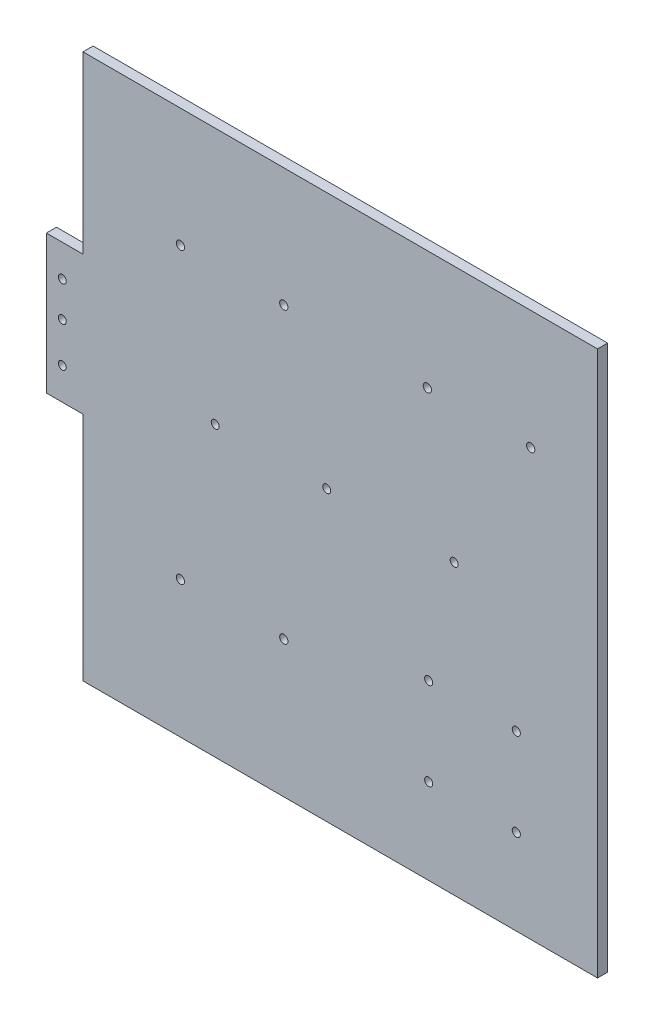
ISO-10303-21;
HEADER;
FILE_DESCRIPTION(('STEP AP214'),'2;1');
FILE_NAME('part.step','',(''),(''),'','','');
FILE_SCHEMA(('AUTOMOTIVE_DESIGN { 1 0 10303 214 1 1 1 1 }'));
ENDSEC;
DATA;
#1=APPLICATION_CONTEXT('core data for automotive mechanical design processes');
#2=APPLICATION_PROTOCOL_DEFINITION('international standard','automotive_design',2000,#1);
#3=PRODUCT_CONTEXT('',#1,'mechanical');
#4=PRODUCT('Part','Part','',(#3));
#5=PRODUCT_RELATED_PRODUCT_CATEGORY('part','',(#4));
#6=PRODUCT_DEFINITION_FORMATION('','',#4);
#7=PRODUCT_DEFINITION_CONTEXT('part definition',#1,'design');
#8=PRODUCT_DEFINITION('design','',#6,#7);
#9=PRODUCT_DEFINITION_SHAPE('','',#8);
#10=(LENGTH_UNIT() NAMED_UNIT(*) SI_UNIT(.MILLI.,.METRE.));
#11=(NAMED_UNIT(*) PLANE_ANGLE_UNIT() SI_UNIT($,.RADIAN.));
#12=(NAMED_UNIT(*) SI_UNIT($,.STERADIAN.) SOLID_ANGLE_UNIT());
#13=UNCERTAINTY_MEASURE_WITH_UNIT(LENGTH_MEASURE(1.E-05),#10,'distance_accuracy_value','');
#14=(GEOMETRIC_REPRESENTATION_CONTEXT(3) GLOBAL_UNCERTAINTY_ASSIGNED_CONTEXT((#13)) GLOBAL_UNIT_ASSIGNED_CONTEXT((#10,
#11,#12)) REPRESENTATION_CONTEXT('',''));
#15=CARTESIAN_POINT('',(0.,0.,0.));
#16=DIRECTION('',(0.,0.,1.));
#17=DIRECTION('',(1.,0.,0.));
#18=AXIS2_PLACEMENT_3D('',#15,#16,#17);
#19=CARTESIAN_POINT('',(691.84061693696,302.611489719056,-6.35));
#20=DIRECTION('',(1.,0.,0.));
#21=DIRECTION('',(0.,0.,-1.));
#22=AXIS2_PLACEMENT_3D('',#19,#20,#21);
#23=PLANE('',#22);
#24=DIRECTION('',(0.,1.,0.));
#25=VECTOR('',#24,1.);
#26=CARTESIAN_POINT('',(691.84061693696,302.611489719056,0.));
#27=LINE('',#26,#25);
#28=CARTESIAN_POINT('',(691.84061693696,302.611489719056,0.));
#29=VERTEX_POINT('',#28);
#30=CARTESIAN_POINT('',(691.84061693696,644.611489719056,0.));
#31=VERTEX_POINT('',#30);
#32=EDGE_CURVE('E134',#29,#31,#27,.T.);
#33=ORIENTED_EDGE('',*,*,#32,.F.);
#34=DIRECTION('',(0.,0.,1.));
#35=VECTOR('',#34,1.);
#36=CARTESIAN_POINT('',(691.84061693696,302.611489719056,-6.35));
#37=LINE('',#36,#35);
#38=CARTESIAN_POINT('',(691.84061693696,302.611489719056,-6.35));
#39=VERTEX_POINT('',#38);
#40=EDGE_CURVE('E11',#39,#29,#37,.T.);
#41=ORIENTED_EDGE('',*,*,#40,.F.);
#42=DIRECTION('',(0.,1.,0.));
#43=VECTOR('',#42,1.);
#44=CARTESIAN_POINT('',(691.84061693696,302.611489719056,-6.35));
#45=LINE('',#44,#43);
#46=CARTESIAN_POINT('',(691.84061693696,644.611489719056,-6.35));
#47=VERTEX_POINT('',#46);
#48=EDGE_CURVE('E155',#39,#47,#45,.T.);
#49=ORIENTED_EDGE('',*,*,#48,.T.);
#50=DIRECTION('',(0.,0.,1.));
#51=VECTOR('',#50,1.);
#52=CARTESIAN_POINT('',(691.84061693696,644.611489719056,-6.35));
#53=LINE('',#52,#51);
#54=EDGE_CURVE('E40',#47,#31,#53,.T.);
#55=ORIENTED_EDGE('',*,*,#54,.T.);
#56=EDGE_LOOP('',(#33,#41,#49,#55));
#57=FACE_BOUND('',#56,.T.);
#58=ADVANCED_FACE('F37',(#57),#23,.T.);
#59=CARTESIAN_POINT('',(691.84061693696,302.611489719056,-6.35));
#60=DIRECTION('',(0.,-1.,0.));
#61=DIRECTION('',(1.,0.,0.));
#62=AXIS2_PLACEMENT_3D('',#59,#60,#61);
#63=PLANE('',#62);
#64=DIRECTION('',(1.,0.,0.));
#65=VECTOR('',#64,1.);
#66=CARTESIAN_POINT('',(691.84061693696,302.611489719056,0.));
#67=LINE('',#66,#65);
#68=CARTESIAN_POINT('',(368.84061693696,302.611489719056,0.));
#69=VERTEX_POINT('',#68);
#70=EDGE_CURVE('E153',#69,#29,#67,.T.);
#71=ORIENTED_EDGE('',*,*,#70,.F.);
#72=DIRECTION('',(0.,0.,1.));
#73=VECTOR('',#72,1.);
#74=CARTESIAN_POINT('',(368.84061693696,302.611489719056,-6.35));
#75=LINE('',#74,#73);
#76=CARTESIAN_POINT('',(368.84061693696,302.611489719056,-6.35));
#77=VERTEX_POINT('',#76);
#78=EDGE_CURVE('E46',#77,#69,#75,.T.);
#79=ORIENTED_EDGE('',*,*,#78,.F.);
#80=DIRECTION('',(1.,0.,0.));
#81=VECTOR('',#80,1.);
#82=CARTESIAN_POINT('',(691.84061693696,302.611489719056,-6.35));
#83=LINE('',#82,#81);
#84=EDGE_CURVE('E124',#77,#39,#83,.T.);
#85=ORIENTED_EDGE('',*,*,#84,.T.);
#86=ORIENTED_EDGE('',*,*,#40,.T.);
#87=EDGE_LOOP('',(#71,#79,#85,#86));
#88=FACE_BOUND('',#87,.T.);
#89=ADVANCED_FACE('F167',(#88),#63,.T.);
#90=CARTESIAN_POINT('',(368.84061693696,447.611489719056,-6.35));
#91=DIRECTION('',(-1.,0.,0.));
#92=DIRECTION('',(0.,0.,1.));
#93=AXIS2_PLACEMENT_3D('',#90,#91,#92);
#94=PLANE('',#93);
#95=DIRECTION('',(0.,-1.,0.));
#96=VECTOR('',#95,1.);
#97=CARTESIAN_POINT('',(368.84061693696,447.611489719056,0.));
#98=LINE('',#97,#96);
#99=CARTESIAN_POINT('',(368.84061693696,447.611489719056,0.));
#100=VERTEX_POINT('',#99);
#101=EDGE_CURVE('E111',#100,#69,#98,.T.);
#102=ORIENTED_EDGE('',*,*,#101,.F.);
#103=DIRECTION('',(0.,0.,1.));
#104=VECTOR('',#103,1.);
#105=CARTESIAN_POINT('',(368.84061693696,447.611489719056,-6.35));
#106=LINE('',#105,#104);
#107=CARTESIAN_POINT('',(368.84061693696,447.611489719056,-6.35));
#108=VERTEX_POINT('',#107);
#109=EDGE_CURVE('E106',#108,#100,#106,.T.);
#110=ORIENTED_EDGE('',*,*,#109,.F.);
#111=DIRECTION('',(0.,-1.,0.));
#112=VECTOR('',#111,1.);
#113=CARTESIAN_POINT('',(368.84061693696,447.611489719056,-6.35));
#114=LINE('',#113,#112);
#115=EDGE_CURVE('E109',#108,#77,#114,.T.);
#116=ORIENTED_EDGE('',*,*,#115,.T.);
#117=ORIENTED_EDGE('',*,*,#78,.T.);
#118=EDGE_LOOP('',(#102,#110,#116,#117));
#119=FACE_BOUND('',#118,.T.);
#120=ADVANCED_FACE('F108',(#119),#94,.T.);
#121=CARTESIAN_POINT('',(368.84061693696,447.611489719056,-6.35));
#122=DIRECTION('',(0.,-1.,0.));
#123=DIRECTION('',(0.,0.,-1.));
#124=AXIS2_PLACEMENT_3D('',#121,#122,#123);
#125=PLANE('',#124);
#126=DIRECTION('',(1.,0.,0.));
#127=VECTOR('',#126,1.);
#128=CARTESIAN_POINT('',(368.84061693696,447.611489719056,0.));
#129=LINE('',#128,#127);
#130=CARTESIAN_POINT('',(345.84061693696,447.611489719056,0.));
#131=VERTEX_POINT('',#130);
#132=EDGE_CURVE('E150',#131,#100,#129,.T.);
#133=ORIENTED_EDGE('',*,*,#132,.F.);
#134=DIRECTION('',(0.,0.,1.));
#135=VECTOR('',#134,1.);
#136=CARTESIAN_POINT('',(345.84061693696,447.611489719056,-6.35));
#137=LINE('',#136,#135);
#138=CARTESIAN_POINT('',(345.84061693696,447.611489719056,-6.35));
#139=VERTEX_POINT('',#138);
#140=EDGE_CURVE('E116',#139,#131,#137,.T.);
#141=ORIENTED_EDGE('',*,*,#140,.F.);
#142=DIRECTION('',(1.,0.,0.));
#143=VECTOR('',#142,1.);
#144=CARTESIAN_POINT('',(368.84061693696,447.611489719056,-6.35));
#145=LINE('',#144,#143);
#146=EDGE_CURVE('E122',#139,#108,#145,.T.);
#147=ORIENTED_EDGE('',*,*,#146,.T.);
#148=ORIENTED_EDGE('',*,*,#109,.T.);
#149=EDGE_LOOP('',(#133,#141,#147,#148));
#150=FACE_BOUND('',#149,.T.);
#151=ADVANCED_FACE('F126',(#150),#125,.T.);
#152=CARTESIAN_POINT('',(345.84061693696,447.611489719056,-6.35));
#153=DIRECTION('',(-1.,0.,0.));
#154=DIRECTION('',(0.,0.,1.));
#155=AXIS2_PLACEMENT_3D('',#152,#153,#154);
#156=PLANE('',#155);
#157=DIRECTION('',(0.,-1.,0.));
#158=VECTOR('',#157,1.);
#159=CARTESIAN_POINT('',(345.84061693696,447.611489719056,0.));
#160=LINE('',#159,#158);
#161=CARTESIAN_POINT('',(345.84061693696,534.611489719056,0.));
#162=VERTEX_POINT('',#161);
#163=EDGE_CURVE('E147',#162,#131,#160,.T.);
#164=ORIENTED_EDGE('',*,*,#163,.F.);
#165=DIRECTION('',(0.,0.,1.));
#166=VECTOR('',#165,1.);
#167=CARTESIAN_POINT('',(345.84061693696,534.611489719056,-6.35));
#168=LINE('',#167,#166);
#169=CARTESIAN_POINT('',(345.84061693696,534.611489719056,-6.35));
#170=VERTEX_POINT('',#169);
#171=EDGE_CURVE('E159',#170,#162,#168,.T.);
#172=ORIENTED_EDGE('',*,*,#171,.F.);
#173=DIRECTION('',(0.,-1.,0.));
#174=VECTOR('',#173,1.);
#175=CARTESIAN_POINT('',(345.84061693696,447.611489719056,-6.35));
#176=LINE('',#175,#174);
#177=EDGE_CURVE('E127',#170,#139,#176,.T.);
#178=ORIENTED_EDGE('',*,*,#177,.T.);
#179=ORIENTED_EDGE('',*,*,#140,.T.);
#180=EDGE_LOOP('',(#164,#172,#178,#179));
#181=FACE_BOUND('',#180,.T.);
#182=ADVANCED_FACE('F180',(#181),#156,.T.);
#183=CARTESIAN_POINT('',(345.84061693696,534.611489719056,-6.35));
#184=DIRECTION('',(0.,1.,0.));
#185=DIRECTION('',(-1.,0.,0.));
#186=AXIS2_PLACEMENT_3D('',#183,#184,#185);
#187=PLANE('',#186);
#188=DIRECTION('',(-1.,0.,0.));
#189=VECTOR('',#188,1.);
#190=CARTESIAN_POINT('',(345.84061693696,534.611489719056,0.));
#191=LINE('',#190,#189);
#192=CARTESIAN_POINT('',(368.84061693696,534.611489719056,0.));
#193=VERTEX_POINT('',#192);
#194=EDGE_CURVE('E144',#193,#162,#191,.T.);
#195=ORIENTED_EDGE('',*,*,#194,.F.);
#196=DIRECTION('',(0.,0.,1.));
#197=VECTOR('',#196,1.);
#198=CARTESIAN_POINT('',(368.84061693696,534.611489719056,-6.35));
#199=LINE('',#198,#197);
#200=CARTESIAN_POINT('',(368.84061693696,534.611489719056,-6.35));
#201=VERTEX_POINT('',#200);
#202=EDGE_CURVE('E161',#201,#193,#199,.T.);
#203=ORIENTED_EDGE('',*,*,#202,.F.);
#204=DIRECTION('',(-1.,0.,0.));
#205=VECTOR('',#204,1.);
#206=CARTESIAN_POINT('',(345.84061693696,534.611489719056,-6.35));
#207=LINE('',#206,#205);
#208=EDGE_CURVE('E129',#201,#170,#207,.T.);
#209=ORIENTED_EDGE('',*,*,#208,.T.);
#210=ORIENTED_EDGE('',*,*,#171,.T.);
#211=EDGE_LOOP('',(#195,#203,#209,#210));
#212=FACE_BOUND('',#211,.T.);
#213=ADVANCED_FACE('F183',(#212),#187,.T.);
#214=CARTESIAN_POINT('',(368.84061693696,644.611489719056,-6.35));
#215=DIRECTION('',(-1.,0.,0.));
#216=DIRECTION('',(0.,0.,1.));
#217=AXIS2_PLACEMENT_3D('',#214,#215,#216);
#218=PLANE('',#217);
#219=DIRECTION('',(0.,-1.,0.));
#220=VECTOR('',#219,1.);
#221=CARTESIAN_POINT('',(368.84061693696,644.611489719056,0.));
#222=LINE('',#221,#220);
#223=CARTESIAN_POINT('',(368.84061693696,644.611489719056,0.));
#224=VERTEX_POINT('',#223);
#225=EDGE_CURVE('E141',#224,#193,#222,.T.);
#226=ORIENTED_EDGE('',*,*,#225,.F.);
#227=DIRECTION('',(0.,0.,1.));
#228=VECTOR('',#227,1.);
#229=CARTESIAN_POINT('',(368.84061693696,644.611489719056,-6.35));
#230=LINE('',#229,#228);
#231=CARTESIAN_POINT('',(368.84061693696,644.611489719056,-6.35));
#232=VERTEX_POINT('',#231);
#233=EDGE_CURVE('E162',#232,#224,#230,.T.);
#234=ORIENTED_EDGE('',*,*,#233,.F.);
#235=DIRECTION('',(0.,-1.,0.));
#236=VECTOR('',#235,1.);
#237=CARTESIAN_POINT('',(368.84061693696,644.611489719056,-6.35));
#238=LINE('',#237,#236);
#239=EDGE_CURVE('E369',#232,#201,#238,.T.);
#240=ORIENTED_EDGE('',*,*,#239,.T.);
#241=ORIENTED_EDGE('',*,*,#202,.T.);
#242=EDGE_LOOP('',(#226,#234,#240,#241));
#243=FACE_BOUND('',#242,.T.);
#244=ADVANCED_FACE('F187',(#243),#218,.T.);
#245=CARTESIAN_POINT('',(691.84061693696,644.611489719056,-6.35));
#246=DIRECTION('',(0.,1.,0.));
#247=DIRECTION('',(-1.,0.,0.));
#248=AXIS2_PLACEMENT_3D('',#245,#246,#247);
#249=PLANE('',#248);
#250=DIRECTION('',(-1.,0.,0.));
#251=VECTOR('',#250,1.);
#252=CARTESIAN_POINT('',(691.84061693696,644.611489719056,0.));
#253=LINE('',#252,#251);
#254=EDGE_CURVE('E137',#31,#224,#253,.T.);
#255=ORIENTED_EDGE('',*,*,#254,.F.);
#256=ORIENTED_EDGE('',*,*,#54,.F.);
#257=DIRECTION('',(-1.,0.,0.));
#258=VECTOR('',#257,1.);
#259=CARTESIAN_POINT('',(691.84061693696,644.611489719056,-6.35));
#260=LINE('',#259,#258);
#261=EDGE_CURVE('E367',#47,#232,#260,.T.);
#262=ORIENTED_EDGE('',*,*,#261,.T.);
#263=ORIENTED_EDGE('',*,*,#233,.T.);
#264=EDGE_LOOP('',(#255,#256,#262,#263));
#265=FACE_BOUND('',#264,.T.);
#266=ADVANCED_FACE('F164',(#265),#249,.T.);
#267=CARTESIAN_POINT('',(0.,0.,-6.35));
#268=DIRECTION('',(0.,0.,1.));
#269=DIRECTION('',(1.,0.,0.));
#270=AXIS2_PLACEMENT_3D('',#267,#268,#269);
#271=PLANE('',#270);
#272=CARTESIAN_POINT('',(640.843810025481,356.289923371629,-6.35));
#273=DIRECTION('',(0.,0.,1.));
#274=DIRECTION('',(1.,0.,0.));
#275=AXIS2_PLACEMENT_3D('',#272,#273,#274);
#276=CIRCLE('',#275,2.55000000000005);
#277=CARTESIAN_POINT('',(643.393810025481,356.289923371629,-6.35));
#278=VERTEX_POINT('',#277);
#279=EDGE_CURVE('E270',#278,#278,#276,.T.);
#280=ORIENTED_EDGE('',*,*,#279,.T.);
#281=EDGE_LOOP('',(#280));
#282=FACE_BOUND('',#281,.T.);
#283=CARTESIAN_POINT('',(585.843810025481,356.289923371629,-6.35));
#284=DIRECTION('',(0.,0.,1.));
#285=DIRECTION('',(1.,0.,0.));
#286=AXIS2_PLACEMENT_3D('',#283,#284,#285);
#287=CIRCLE('',#286,2.55000000000005);
#288=CARTESIAN_POINT('',(588.393810025481,356.289923371629,-6.35));
#289=VERTEX_POINT('',#288);
#290=EDGE_CURVE('E278',#289,#289,#287,.T.);
#291=ORIENTED_EDGE('',*,*,#290,.T.);
#292=EDGE_LOOP('',(#291));
#293=FACE_BOUND('',#292,.T.);
#294=CARTESIAN_POINT('',(640.843810025481,411.289923371629,-6.35));
#295=DIRECTION('',(0.,0.,1.));
#296=DIRECTION('',(1.,0.,0.));
#297=AXIS2_PLACEMENT_3D('',#294,#295,#296);
#298=CIRCLE('',#297,2.55000000000005);
#299=CARTESIAN_POINT('',(643.393810025481,411.289923371629,-6.35));
#300=VERTEX_POINT('',#299);
#301=EDGE_CURVE('E284',#300,#300,#298,.T.);
#302=ORIENTED_EDGE('',*,*,#301,.T.);
#303=EDGE_LOOP('',(#302));
#304=FACE_BOUND('',#303,.T.);
#305=CARTESIAN_POINT('',(585.843810025481,411.289923371629,-6.35));
#306=DIRECTION('',(0.,0.,1.));
#307=DIRECTION('',(1.,0.,0.));
#308=AXIS2_PLACEMENT_3D('',#305,#306,#307);
#309=CIRCLE('',#308,2.55000000000005);
#310=CARTESIAN_POINT('',(588.393810025481,411.289923371629,-6.35));
#311=VERTEX_POINT('',#310);
#312=EDGE_CURVE('E290',#311,#311,#309,.T.);
#313=ORIENTED_EDGE('',*,*,#312,.T.);
#314=EDGE_LOOP('',(#313));
#315=FACE_BOUND('',#314,.T.);
#316=CARTESIAN_POINT('',(494.9,388.410571955932,-6.35));
#317=DIRECTION('',(0.,0.,1.));
#318=DIRECTION('',(1.,0.,0.));
#319=AXIS2_PLACEMENT_3D('',#316,#317,#318);
#320=CIRCLE('',#319,2.59999999999999);
#321=CARTESIAN_POINT('',(497.5,388.410571955932,-6.35));
#322=VERTEX_POINT('',#321);
#323=EDGE_CURVE('E296',#322,#322,#320,.T.);
#324=ORIENTED_EDGE('',*,*,#323,.T.);
#325=EDGE_LOOP('',(#324));
#326=FACE_BOUND('',#325,.T.);
#327=CARTESIAN_POINT('',(430.,388.410571955932,-6.35));
#328=DIRECTION('',(0.,0.,1.));
#329=DIRECTION('',(1.,0.,0.));
#330=AXIS2_PLACEMENT_3D('',#327,#328,#329);
#331=CIRCLE('',#330,2.59999999999999);
#332=CARTESIAN_POINT('',(432.6,388.410571955932,-6.35));
#333=VERTEX_POINT('',#332);
#334=EDGE_CURVE('E302',#333,#333,#331,.T.);
#335=ORIENTED_EDGE('',*,*,#334,.T.);
#336=EDGE_LOOP('',(#335));
#337=FACE_BOUND('',#336,.T.);
#338=CARTESIAN_POINT('',(649.9,570.,-6.35));
#339=DIRECTION('',(0.,0.,1.));
#340=DIRECTION('',(1.,0.,0.));
#341=AXIS2_PLACEMENT_3D('',#338,#339,#340);
#342=CIRCLE('',#341,2.60000000000016);
#343=CARTESIAN_POINT('',(652.5,570.,-6.35));
#344=VERTEX_POINT('',#343);
#345=EDGE_CURVE('E308',#344,#344,#342,.T.);
#346=ORIENTED_EDGE('',*,*,#345,.T.);
#347=EDGE_LOOP('',(#346));
#348=FACE_BOUND('',#347,.T.);
#349=CARTESIAN_POINT('',(585.,570.,-6.35));
#350=DIRECTION('',(0.,0.,1.));
#351=DIRECTION('',(1.,0.,0.));
#352=AXIS2_PLACEMENT_3D('',#349,#350,#351);
#353=CIRCLE('',#352,2.60000000000005);
#354=CARTESIAN_POINT('',(587.6,570.,-6.35));
#355=VERTEX_POINT('',#354);
#356=EDGE_CURVE('E314',#355,#355,#353,.T.);
#357=ORIENTED_EDGE('',*,*,#356,.T.);
#358=EDGE_LOOP('',(#357));
#359=FACE_BOUND('',#358,.T.);
#360=CARTESIAN_POINT('',(601.84061693696,483.611489719056,-6.35));
#361=DIRECTION('',(0.,0.,1.));
#362=DIRECTION('',(1.,0.,0.));
#363=AXIS2_PLACEMENT_3D('',#360,#361,#362);
#364=CIRCLE('',#363,2.49999999999984);
#365=CARTESIAN_POINT('',(604.340616936959,483.611489719056,-6.35));
#366=VERTEX_POINT('',#365);
#367=EDGE_CURVE('E320',#366,#366,#364,.T.);
#368=ORIENTED_EDGE('',*,*,#367,.T.);
#369=EDGE_LOOP('',(#368));
#370=FACE_BOUND('',#369,.T.);
#371=CARTESIAN_POINT('',(521.84061693696,483.611489719056,-6.35));
#372=DIRECTION('',(0.,0.,1.));
#373=DIRECTION('',(1.,0.,0.));
#374=AXIS2_PLACEMENT_3D('',#371,#372,#373);
#375=CIRCLE('',#374,2.49999999999995);
#376=CARTESIAN_POINT('',(524.34061693696,483.611489719056,-6.35));
#377=VERTEX_POINT('',#376);
#378=EDGE_CURVE('E326',#377,#377,#375,.T.);
#379=ORIENTED_EDGE('',*,*,#378,.T.);
#380=EDGE_LOOP('',(#379));
#381=FACE_BOUND('',#380,.T.);
#382=CARTESIAN_POINT('',(451.84061693696,483.611489719056,-6.35));
#383=DIRECTION('',(0.,0.,1.));
#384=DIRECTION('',(1.,0.,0.));
#385=AXIS2_PLACEMENT_3D('',#382,#383,#384);
#386=CIRCLE('',#385,2.5);
#387=CARTESIAN_POINT('',(454.34061693696,483.611489719056,-6.35));
#388=VERTEX_POINT('',#387);
#389=EDGE_CURVE('E332',#388,#388,#386,.T.);
#390=ORIENTED_EDGE('',*,*,#389,.T.);
#391=EDGE_LOOP('',(#390));
#392=FACE_BOUND('',#391,.T.);
#393=CARTESIAN_POINT('',(494.9,570.,-6.35));
#394=DIRECTION('',(0.,0.,1.));
#395=DIRECTION('',(1.,0.,0.));
#396=AXIS2_PLACEMENT_3D('',#393,#394,#395);
#397=CIRCLE('',#396,2.59999999999999);
#398=CARTESIAN_POINT('',(497.5,570.,-6.35));
#399=VERTEX_POINT('',#398);
#400=EDGE_CURVE('E338',#399,#399,#397,.T.);
#401=ORIENTED_EDGE('',*,*,#400,.T.);
#402=EDGE_LOOP('',(#401));
#403=FACE_BOUND('',#402,.T.);
#404=CARTESIAN_POINT('',(430.,570.,-6.35));
#405=DIRECTION('',(0.,0.,1.));
#406=DIRECTION('',(1.,0.,0.));
#407=AXIS2_PLACEMENT_3D('',#404,#405,#406);
#408=CIRCLE('',#407,2.59999999999999);
#409=CARTESIAN_POINT('',(432.6,570.,-6.35));
#410=VERTEX_POINT('',#409);
#411=EDGE_CURVE('E344',#410,#410,#408,.T.);
#412=ORIENTED_EDGE('',*,*,#411,.T.);
#413=EDGE_LOOP('',(#412));
#414=FACE_BOUND('',#413,.T.);
#415=CARTESIAN_POINT('',(355.84061693696,467.611489719056,-6.35));
#416=DIRECTION('',(0.,0.,1.));
#417=DIRECTION('',(1.,0.,0.));
#418=AXIS2_PLACEMENT_3D('',#415,#416,#417);
#419=CIRCLE('',#418,2.5);
#420=CARTESIAN_POINT('',(358.34061693696,467.611489719056,-6.35));
#421=VERTEX_POINT('',#420);
#422=EDGE_CURVE('E350',#421,#421,#419,.T.);
#423=ORIENTED_EDGE('',*,*,#422,.T.);
#424=EDGE_LOOP('',(#423));
#425=FACE_BOUND('',#424,.T.);
#426=CARTESIAN_POINT('',(355.84061693696,492.611489719056,-6.35));
#427=DIRECTION('',(0.,0.,1.));
#428=DIRECTION('',(1.,0.,0.));
#429=AXIS2_PLACEMENT_3D('',#426,#427,#428);
#430=CIRCLE('',#429,2.5);
#431=CARTESIAN_POINT('',(358.34061693696,492.611489719056,-6.35));
#432=VERTEX_POINT('',#431);
#433=EDGE_CURVE('E356',#432,#432,#430,.T.);
#434=ORIENTED_EDGE('',*,*,#433,.T.);
#435=EDGE_LOOP('',(#434));
#436=FACE_BOUND('',#435,.T.);
#437=CARTESIAN_POINT('',(355.84061693696,514.611489719056,-6.35));
#438=DIRECTION('',(0.,0.,1.));
#439=DIRECTION('',(1.,0.,0.));
#440=AXIS2_PLACEMENT_3D('',#437,#438,#439);
#441=CIRCLE('',#440,2.5);
#442=CARTESIAN_POINT('',(358.34061693696,514.611489719056,-6.35));
#443=VERTEX_POINT('',#442);
#444=EDGE_CURVE('E138',#443,#443,#441,.T.);
#445=ORIENTED_EDGE('',*,*,#444,.T.);
#446=EDGE_LOOP('',(#445));
#447=FACE_BOUND('',#446,.T.);
#448=ORIENTED_EDGE('',*,*,#48,.F.);
#449=ORIENTED_EDGE('',*,*,#84,.F.);
#450=ORIENTED_EDGE('',*,*,#115,.F.);
#451=ORIENTED_EDGE('',*,*,#146,.F.);
#452=ORIENTED_EDGE('',*,*,#177,.F.);
#453=ORIENTED_EDGE('',*,*,#208,.F.);
#454=ORIENTED_EDGE('',*,*,#239,.F.);
#455=ORIENTED_EDGE('',*,*,#261,.F.);
#456=EDGE_LOOP('',(#448,#449,#450,#451,#452,#453,#454,#455));
#457=FACE_BOUND('',#456,.T.);
#458=ADVANCED_FACE('F120',(#282,#293,#304,#315,#326,#337,#348,#359,#370,#381,#392,#403,#414,
#425,#436,#447,#457),#271,.F.);
#459=CARTESIAN_POINT('',(0.,0.,0.));
#460=DIRECTION('',(0.,0.,1.));
#461=DIRECTION('',(1.,0.,0.));
#462=AXIS2_PLACEMENT_3D('',#459,#460,#461);
#463=PLANE('',#462);
#464=CARTESIAN_POINT('',(640.843810025481,356.289923371629,0.));
#465=DIRECTION('',(0.,0.,1.));
#466=DIRECTION('',(1.,0.,0.));
#467=AXIS2_PLACEMENT_3D('',#464,#465,#466);
#468=CIRCLE('',#467,2.55000000000005);
#469=CARTESIAN_POINT('',(643.393810025481,356.289923371629,0.));
#470=VERTEX_POINT('',#469);
#471=EDGE_CURVE('E273',#470,#470,#468,.T.);
#472=ORIENTED_EDGE('',*,*,#471,.F.);
#473=EDGE_LOOP('',(#472));
#474=FACE_BOUND('',#473,.T.);
#475=CARTESIAN_POINT('',(585.843810025481,356.289923371629,0.));
#476=DIRECTION('',(0.,0.,1.));
#477=DIRECTION('',(1.,0.,0.));
#478=AXIS2_PLACEMENT_3D('',#475,#476,#477);
#479=CIRCLE('',#478,2.55000000000005);
#480=CARTESIAN_POINT('',(588.393810025481,356.289923371629,0.));
#481=VERTEX_POINT('',#480);
#482=EDGE_CURVE('E275',#481,#481,#479,.T.);
#483=ORIENTED_EDGE('',*,*,#482,.F.);
#484=EDGE_LOOP('',(#483));
#485=FACE_BOUND('',#484,.T.);
#486=CARTESIAN_POINT('',(640.843810025481,411.289923371629,0.));
#487=DIRECTION('',(0.,0.,1.));
#488=DIRECTION('',(1.,0.,0.));
#489=AXIS2_PLACEMENT_3D('',#486,#487,#488);
#490=CIRCLE('',#489,2.55000000000005);
#491=CARTESIAN_POINT('',(643.393810025481,411.289923371629,0.));
#492=VERTEX_POINT('',#491);
#493=EDGE_CURVE('E281',#492,#492,#490,.T.);
#494=ORIENTED_EDGE('',*,*,#493,.F.);
#495=EDGE_LOOP('',(#494));
#496=FACE_BOUND('',#495,.T.);
#497=CARTESIAN_POINT('',(585.843810025481,411.289923371629,0.));
#498=DIRECTION('',(0.,0.,1.));
#499=DIRECTION('',(1.,0.,0.));
#500=AXIS2_PLACEMENT_3D('',#497,#498,#499);
#501=CIRCLE('',#500,2.55000000000005);
#502=CARTESIAN_POINT('',(588.393810025481,411.289923371629,0.));
#503=VERTEX_POINT('',#502);
#504=EDGE_CURVE('E287',#503,#503,#501,.T.);
#505=ORIENTED_EDGE('',*,*,#504,.F.);
#506=EDGE_LOOP('',(#505));
#507=FACE_BOUND('',#506,.T.);
#508=CARTESIAN_POINT('',(494.9,388.410571955932,0.));
#509=DIRECTION('',(0.,0.,1.));
#510=DIRECTION('',(1.,0.,0.));
#511=AXIS2_PLACEMENT_3D('',#508,#509,#510);
#512=CIRCLE('',#511,2.59999999999999);
#513=CARTESIAN_POINT('',(497.5,388.410571955932,0.));
#514=VERTEX_POINT('',#513);
#515=EDGE_CURVE('E293',#514,#514,#512,.T.);
#516=ORIENTED_EDGE('',*,*,#515,.F.);
#517=EDGE_LOOP('',(#516));
#518=FACE_BOUND('',#517,.T.);
#519=CARTESIAN_POINT('',(430.,388.410571955932,0.));
#520=DIRECTION('',(0.,0.,1.));
#521=DIRECTION('',(1.,0.,0.));
#522=AXIS2_PLACEMENT_3D('',#519,#520,#521);
#523=CIRCLE('',#522,2.59999999999999);
#524=CARTESIAN_POINT('',(432.6,388.410571955932,0.));
#525=VERTEX_POINT('',#524);
#526=EDGE_CURVE('E299',#525,#525,#523,.T.);
#527=ORIENTED_EDGE('',*,*,#526,.F.);
#528=EDGE_LOOP('',(#527));
#529=FACE_BOUND('',#528,.T.);
#530=CARTESIAN_POINT('',(649.9,570.,0.));
#531=DIRECTION('',(0.,0.,1.));
#532=DIRECTION('',(1.,0.,0.));
#533=AXIS2_PLACEMENT_3D('',#530,#531,#532);
#534=CIRCLE('',#533,2.60000000000016);
#535=CARTESIAN_POINT('',(652.5,570.,0.));
#536=VERTEX_POINT('',#535);
#537=EDGE_CURVE('E305',#536,#536,#534,.T.);
#538=ORIENTED_EDGE('',*,*,#537,.F.);
#539=EDGE_LOOP('',(#538));
#540=FACE_BOUND('',#539,.T.);
#541=CARTESIAN_POINT('',(585.,570.,0.));
#542=DIRECTION('',(0.,0.,1.));
#543=DIRECTION('',(1.,0.,0.));
#544=AXIS2_PLACEMENT_3D('',#541,#542,#543);
#545=CIRCLE('',#544,2.60000000000005);
#546=CARTESIAN_POINT('',(587.6,570.,0.));
#547=VERTEX_POINT('',#546);
#548=EDGE_CURVE('E311',#547,#547,#545,.T.);
#549=ORIENTED_EDGE('',*,*,#548,.F.);
#550=EDGE_LOOP('',(#549));
#551=FACE_BOUND('',#550,.T.);
#552=CARTESIAN_POINT('',(601.84061693696,483.611489719056,0.));
#553=DIRECTION('',(0.,0.,1.));
#554=DIRECTION('',(1.,0.,0.));
#555=AXIS2_PLACEMENT_3D('',#552,#553,#554);
#556=CIRCLE('',#555,2.49999999999984);
#557=CARTESIAN_POINT('',(604.340616936959,483.611489719056,0.));
#558=VERTEX_POINT('',#557);
#559=EDGE_CURVE('E317',#558,#558,#556,.T.);
#560=ORIENTED_EDGE('',*,*,#559,.F.);
#561=EDGE_LOOP('',(#560));
#562=FACE_BOUND('',#561,.T.);
#563=CARTESIAN_POINT('',(521.84061693696,483.611489719056,0.));
#564=DIRECTION('',(0.,0.,1.));
#565=DIRECTION('',(1.,0.,0.));
#566=AXIS2_PLACEMENT_3D('',#563,#564,#565);
#567=CIRCLE('',#566,2.49999999999995);
#568=CARTESIAN_POINT('',(524.34061693696,483.611489719056,0.));
#569=VERTEX_POINT('',#568);
#570=EDGE_CURVE('E323',#569,#569,#567,.T.);
#571=ORIENTED_EDGE('',*,*,#570,.F.);
#572=EDGE_LOOP('',(#571));
#573=FACE_BOUND('',#572,.T.);
#574=CARTESIAN_POINT('',(451.84061693696,483.611489719056,0.));
#575=DIRECTION('',(0.,0.,1.));
#576=DIRECTION('',(1.,0.,0.));
#577=AXIS2_PLACEMENT_3D('',#574,#575,#576);
#578=CIRCLE('',#577,2.5);
#579=CARTESIAN_POINT('',(454.34061693696,483.611489719056,0.));
#580=VERTEX_POINT('',#579);
#581=EDGE_CURVE('E329',#580,#580,#578,.T.);
#582=ORIENTED_EDGE('',*,*,#581,.F.);
#583=EDGE_LOOP('',(#582));
#584=FACE_BOUND('',#583,.T.);
#585=CARTESIAN_POINT('',(494.9,570.,0.));
#586=DIRECTION('',(0.,0.,1.));
#587=DIRECTION('',(1.,0.,0.));
#588=AXIS2_PLACEMENT_3D('',#585,#586,#587);
#589=CIRCLE('',#588,2.59999999999999);
#590=CARTESIAN_POINT('',(497.5,570.,0.));
#591=VERTEX_POINT('',#590);
#592=EDGE_CURVE('E335',#591,#591,#589,.T.);
#593=ORIENTED_EDGE('',*,*,#592,.F.);
#594=EDGE_LOOP('',(#593));
#595=FACE_BOUND('',#594,.T.);
#596=CARTESIAN_POINT('',(430.,570.,0.));
#597=DIRECTION('',(0.,0.,1.));
#598=DIRECTION('',(1.,0.,0.));
#599=AXIS2_PLACEMENT_3D('',#596,#597,#598);
#600=CIRCLE('',#599,2.59999999999999);
#601=CARTESIAN_POINT('',(432.6,570.,0.));
#602=VERTEX_POINT('',#601);
#603=EDGE_CURVE('E341',#602,#602,#600,.T.);
#604=ORIENTED_EDGE('',*,*,#603,.F.);
#605=EDGE_LOOP('',(#604));
#606=FACE_BOUND('',#605,.T.);
#607=CARTESIAN_POINT('',(355.84061693696,467.611489719056,0.));
#608=DIRECTION('',(0.,0.,1.));
#609=DIRECTION('',(1.,0.,0.));
#610=AXIS2_PLACEMENT_3D('',#607,#608,#609);
#611=CIRCLE('',#610,2.5);
#612=CARTESIAN_POINT('',(358.34061693696,467.611489719056,0.));
#613=VERTEX_POINT('',#612);
#614=EDGE_CURVE('E347',#613,#613,#611,.T.);
#615=ORIENTED_EDGE('',*,*,#614,.F.);
#616=EDGE_LOOP('',(#615));
#617=FACE_BOUND('',#616,.T.);
#618=CARTESIAN_POINT('',(355.84061693696,492.611489719056,0.));
#619=DIRECTION('',(0.,0.,1.));
#620=DIRECTION('',(1.,0.,0.));
#621=AXIS2_PLACEMENT_3D('',#618,#619,#620);
#622=CIRCLE('',#621,2.5);
#623=CARTESIAN_POINT('',(358.34061693696,492.611489719056,0.));
#624=VERTEX_POINT('',#623);
#625=EDGE_CURVE('E353',#624,#624,#622,.T.);
#626=ORIENTED_EDGE('',*,*,#625,.F.);
#627=EDGE_LOOP('',(#626));
#628=FACE_BOUND('',#627,.T.);
#629=CARTESIAN_POINT('',(355.84061693696,514.611489719056,0.));
#630=DIRECTION('',(0.,0.,1.));
#631=DIRECTION('',(1.,0.,0.));
#632=AXIS2_PLACEMENT_3D('',#629,#630,#631);
#633=CIRCLE('',#632,2.5);
#634=CARTESIAN_POINT('',(358.34061693696,514.611489719056,0.));
#635=VERTEX_POINT('',#634);
#636=EDGE_CURVE('E359',#635,#635,#633,.T.);
#637=ORIENTED_EDGE('',*,*,#636,.F.);
#638=EDGE_LOOP('',(#637));
#639=FACE_BOUND('',#638,.T.);
#640=ORIENTED_EDGE('',*,*,#32,.T.);
#641=ORIENTED_EDGE('',*,*,#254,.T.);
#642=ORIENTED_EDGE('',*,*,#225,.T.);
#643=ORIENTED_EDGE('',*,*,#194,.T.);
#644=ORIENTED_EDGE('',*,*,#163,.T.);
#645=ORIENTED_EDGE('',*,*,#132,.T.);
#646=ORIENTED_EDGE('',*,*,#101,.T.);
#647=ORIENTED_EDGE('',*,*,#70,.T.);
#648=EDGE_LOOP('',(#640,#641,#642,#643,#644,#645,#646,#647));
#649=FACE_BOUND('',#648,.T.);
#650=ADVANCED_FACE('F166',(#474,#485,#496,#507,#518,#529,#540,#551,#562,#573,#584,#595,#606,
#617,#628,#639,#649),#463,.T.);
#651=CARTESIAN_POINT('',(355.84061693696,514.611489719056,-6.35));
#652=DIRECTION('',(0.,0.,1.));
#653=DIRECTION('',(1.,0.,0.));
#654=AXIS2_PLACEMENT_3D('',#651,#652,#653);
#655=CYLINDRICAL_SURFACE('',#654,2.5);
#656=ORIENTED_EDGE('',*,*,#444,.F.);
#657=EDGE_LOOP('',(#656));
#658=FACE_BOUND('',#657,.T.);
#659=ORIENTED_EDGE('',*,*,#636,.T.);
#660=EDGE_LOOP('',(#659));
#661=FACE_BOUND('',#660,.T.);
#662=ADVANCED_FACE('F199',(#658,#661),#655,.F.);
#663=CARTESIAN_POINT('',(355.84061693696,492.611489719056,-6.35));
#664=DIRECTION('',(0.,0.,1.));
#665=DIRECTION('',(1.,0.,0.));
#666=AXIS2_PLACEMENT_3D('',#663,#664,#665);
#667=CYLINDRICAL_SURFACE('',#666,2.5);
#668=ORIENTED_EDGE('',*,*,#433,.F.);
#669=EDGE_LOOP('',(#668));
#670=FACE_BOUND('',#669,.T.);
#671=ORIENTED_EDGE('',*,*,#625,.T.);
#672=EDGE_LOOP('',(#671));
#673=FACE_BOUND('',#672,.T.);
#674=ADVANCED_FACE('F206',(#670,#673),#667,.F.);
#675=CARTESIAN_POINT('',(355.84061693696,467.611489719056,-6.35));
#676=DIRECTION('',(0.,0.,1.));
#677=DIRECTION('',(1.,0.,0.));
#678=AXIS2_PLACEMENT_3D('',#675,#676,#677);
#679=CYLINDRICAL_SURFACE('',#678,2.5);
#680=ORIENTED_EDGE('',*,*,#422,.F.);
#681=EDGE_LOOP('',(#680));
#682=FACE_BOUND('',#681,.T.);
#683=ORIENTED_EDGE('',*,*,#614,.T.);
#684=EDGE_LOOP('',(#683));
#685=FACE_BOUND('',#684,.T.);
#686=ADVANCED_FACE('F210',(#682,#685),#679,.F.);
#687=CARTESIAN_POINT('',(430.,570.,-6.35));
#688=DIRECTION('',(0.,0.,1.));
#689=DIRECTION('',(1.,0.,0.));
#690=AXIS2_PLACEMENT_3D('',#687,#688,#689);
#691=CYLINDRICAL_SURFACE('',#690,2.59999999999999);
#692=ORIENTED_EDGE('',*,*,#411,.F.);
#693=EDGE_LOOP('',(#692));
#694=FACE_BOUND('',#693,.T.);
#695=ORIENTED_EDGE('',*,*,#603,.T.);
#696=EDGE_LOOP('',(#695));
#697=FACE_BOUND('',#696,.T.);
#698=ADVANCED_FACE('F214',(#694,#697),#691,.F.);
#699=CARTESIAN_POINT('',(494.9,570.,-6.35));
#700=DIRECTION('',(0.,0.,1.));
#701=DIRECTION('',(1.,0.,0.));
#702=AXIS2_PLACEMENT_3D('',#699,#700,#701);
#703=CYLINDRICAL_SURFACE('',#702,2.59999999999999);
#704=ORIENTED_EDGE('',*,*,#400,.F.);
#705=EDGE_LOOP('',(#704));
#706=FACE_BOUND('',#705,.T.);
#707=ORIENTED_EDGE('',*,*,#592,.T.);
#708=EDGE_LOOP('',(#707));
#709=FACE_BOUND('',#708,.T.);
#710=ADVANCED_FACE('F218',(#706,#709),#703,.F.);
#711=CARTESIAN_POINT('',(451.84061693696,483.611489719056,-6.35));
#712=DIRECTION('',(0.,0.,1.));
#713=DIRECTION('',(1.,0.,0.));
#714=AXIS2_PLACEMENT_3D('',#711,#712,#713);
#715=CYLINDRICAL_SURFACE('',#714,2.5);
#716=ORIENTED_EDGE('',*,*,#389,.F.);
#717=EDGE_LOOP('',(#716));
#718=FACE_BOUND('',#717,.T.);
#719=ORIENTED_EDGE('',*,*,#581,.T.);
#720=EDGE_LOOP('',(#719));
#721=FACE_BOUND('',#720,.T.);
#722=ADVANCED_FACE('F222',(#718,#721),#715,.F.);
#723=CARTESIAN_POINT('',(521.84061693696,483.611489719056,-6.35));
#724=DIRECTION('',(0.,0.,1.));
#725=DIRECTION('',(1.,0.,0.));
#726=AXIS2_PLACEMENT_3D('',#723,#724,#725);
#727=CYLINDRICAL_SURFACE('',#726,2.49999999999995);
#728=ORIENTED_EDGE('',*,*,#378,.F.);
#729=EDGE_LOOP('',(#728));
#730=FACE_BOUND('',#729,.T.);
#731=ORIENTED_EDGE('',*,*,#570,.T.);
#732=EDGE_LOOP('',(#731));
#733=FACE_BOUND('',#732,.T.);
#734=ADVANCED_FACE('F226',(#730,#733),#727,.F.);
#735=CARTESIAN_POINT('',(601.84061693696,483.611489719056,-6.35));
#736=DIRECTION('',(0.,0.,1.));
#737=DIRECTION('',(1.,0.,0.));
#738=AXIS2_PLACEMENT_3D('',#735,#736,#737);
#739=CYLINDRICAL_SURFACE('',#738,2.49999999999984);
#740=ORIENTED_EDGE('',*,*,#367,.F.);
#741=EDGE_LOOP('',(#740));
#742=FACE_BOUND('',#741,.T.);
#743=ORIENTED_EDGE('',*,*,#559,.T.);
#744=EDGE_LOOP('',(#743));
#745=FACE_BOUND('',#744,.T.);
#746=ADVANCED_FACE('F230',(#742,#745),#739,.F.);
#747=CARTESIAN_POINT('',(585.,570.,-6.35));
#748=DIRECTION('',(0.,0.,1.));
#749=DIRECTION('',(1.,0.,0.));
#750=AXIS2_PLACEMENT_3D('',#747,#748,#749);
#751=CYLINDRICAL_SURFACE('',#750,2.60000000000005);
#752=ORIENTED_EDGE('',*,*,#356,.F.);
#753=EDGE_LOOP('',(#752));
#754=FACE_BOUND('',#753,.T.);
#755=ORIENTED_EDGE('',*,*,#548,.T.);
#756=EDGE_LOOP('',(#755));
#757=FACE_BOUND('',#756,.T.);
#758=ADVANCED_FACE('F234',(#754,#757),#751,.F.);
#759=CARTESIAN_POINT('',(649.9,570.,-6.35));
#760=DIRECTION('',(0.,0.,1.));
#761=DIRECTION('',(1.,0.,0.));
#762=AXIS2_PLACEMENT_3D('',#759,#760,#761);
#763=CYLINDRICAL_SURFACE('',#762,2.60000000000016);
#764=ORIENTED_EDGE('',*,*,#345,.F.);
#765=EDGE_LOOP('',(#764));
#766=FACE_BOUND('',#765,.T.);
#767=ORIENTED_EDGE('',*,*,#537,.T.);
#768=EDGE_LOOP('',(#767));
#769=FACE_BOUND('',#768,.T.);
#770=ADVANCED_FACE('F238',(#766,#769),#763,.F.);
#771=CARTESIAN_POINT('',(430.,388.410571955932,-6.35));
#772=DIRECTION('',(0.,0.,1.));
#773=DIRECTION('',(1.,0.,0.));
#774=AXIS2_PLACEMENT_3D('',#771,#772,#773);
#775=CYLINDRICAL_SURFACE('',#774,2.59999999999999);
#776=ORIENTED_EDGE('',*,*,#334,.F.);
#777=EDGE_LOOP('',(#776));
#778=FACE_BOUND('',#777,.T.);
#779=ORIENTED_EDGE('',*,*,#526,.T.);
#780=EDGE_LOOP('',(#779));
#781=FACE_BOUND('',#780,.T.);
#782=ADVANCED_FACE('F242',(#778,#781),#775,.F.);
#783=CARTESIAN_POINT('',(494.9,388.410571955932,-6.35));
#784=DIRECTION('',(0.,0.,1.));
#785=DIRECTION('',(1.,0.,0.));
#786=AXIS2_PLACEMENT_3D('',#783,#784,#785);
#787=CYLINDRICAL_SURFACE('',#786,2.59999999999999);
#788=ORIENTED_EDGE('',*,*,#323,.F.);
#789=EDGE_LOOP('',(#788));
#790=FACE_BOUND('',#789,.T.);
#791=ORIENTED_EDGE('',*,*,#515,.T.);
#792=EDGE_LOOP('',(#791));
#793=FACE_BOUND('',#792,.T.);
#794=ADVANCED_FACE('F246',(#790,#793),#787,.F.);
#795=CARTESIAN_POINT('',(585.843810025481,411.289923371629,-6.35));
#796=DIRECTION('',(0.,0.,1.));
#797=DIRECTION('',(1.,0.,0.));
#798=AXIS2_PLACEMENT_3D('',#795,#796,#797);
#799=CYLINDRICAL_SURFACE('',#798,2.55000000000005);
#800=ORIENTED_EDGE('',*,*,#312,.F.);
#801=EDGE_LOOP('',(#800));
#802=FACE_BOUND('',#801,.T.);
#803=ORIENTED_EDGE('',*,*,#504,.T.);
#804=EDGE_LOOP('',(#803));
#805=FACE_BOUND('',#804,.T.);
#806=ADVANCED_FACE('F250',(#802,#805),#799,.F.);
#807=CARTESIAN_POINT('',(640.843810025481,411.289923371629,-6.35));
#808=DIRECTION('',(0.,0.,1.));
#809=DIRECTION('',(1.,0.,0.));
#810=AXIS2_PLACEMENT_3D('',#807,#808,#809);
#811=CYLINDRICAL_SURFACE('',#810,2.55000000000005);
#812=ORIENTED_EDGE('',*,*,#301,.F.);
#813=EDGE_LOOP('',(#812));
#814=FACE_BOUND('',#813,.T.);
#815=ORIENTED_EDGE('',*,*,#493,.T.);
#816=EDGE_LOOP('',(#815));
#817=FACE_BOUND('',#816,.T.);
#818=ADVANCED_FACE('F254',(#814,#817),#811,.F.);
#819=CARTESIAN_POINT('',(585.843810025481,356.289923371629,-6.35));
#820=DIRECTION('',(0.,0.,1.));
#821=DIRECTION('',(1.,0.,0.));
#822=AXIS2_PLACEMENT_3D('',#819,#820,#821);
#823=CYLINDRICAL_SURFACE('',#822,2.55000000000005);
#824=ORIENTED_EDGE('',*,*,#290,.F.);
#825=EDGE_LOOP('',(#824));
#826=FACE_BOUND('',#825,.T.);
#827=ORIENTED_EDGE('',*,*,#482,.T.);
#828=EDGE_LOOP('',(#827));
#829=FACE_BOUND('',#828,.T.);
#830=ADVANCED_FACE('F258',(#826,#829),#823,.F.);
#831=CARTESIAN_POINT('',(640.843810025481,356.289923371629,-6.35));
#832=DIRECTION('',(0.,0.,1.));
#833=DIRECTION('',(1.,0.,0.));
#834=AXIS2_PLACEMENT_3D('',#831,#832,#833);
#835=CYLINDRICAL_SURFACE('',#834,2.55000000000005);
#836=ORIENTED_EDGE('',*,*,#279,.F.);
#837=EDGE_LOOP('',(#836));
#838=FACE_BOUND('',#837,.T.);
#839=ORIENTED_EDGE('',*,*,#471,.T.);
#840=EDGE_LOOP('',(#839));
#841=FACE_BOUND('',#840,.T.);
#842=ADVANCED_FACE('F262',(#838,#841),#835,.F.);
#843=CLOSED_SHELL('',(#58,#89,#120,#151,#182,#213,#244,#266,#458,#650,#662,#674,#686,#698,#710,
#722,#734,#746,#758,#770,#782,#794,#806,#818,#830,#842));
#844=MANIFOLD_SOLID_BREP('B2',#843);
#845=ADVANCED_BREP_SHAPE_REPRESENTATION('',(#18,#844),#14);
#846=SHAPE_DEFINITION_REPRESENTATION(#9,#845);
ENDSEC;
END-ISO-10303-21;
